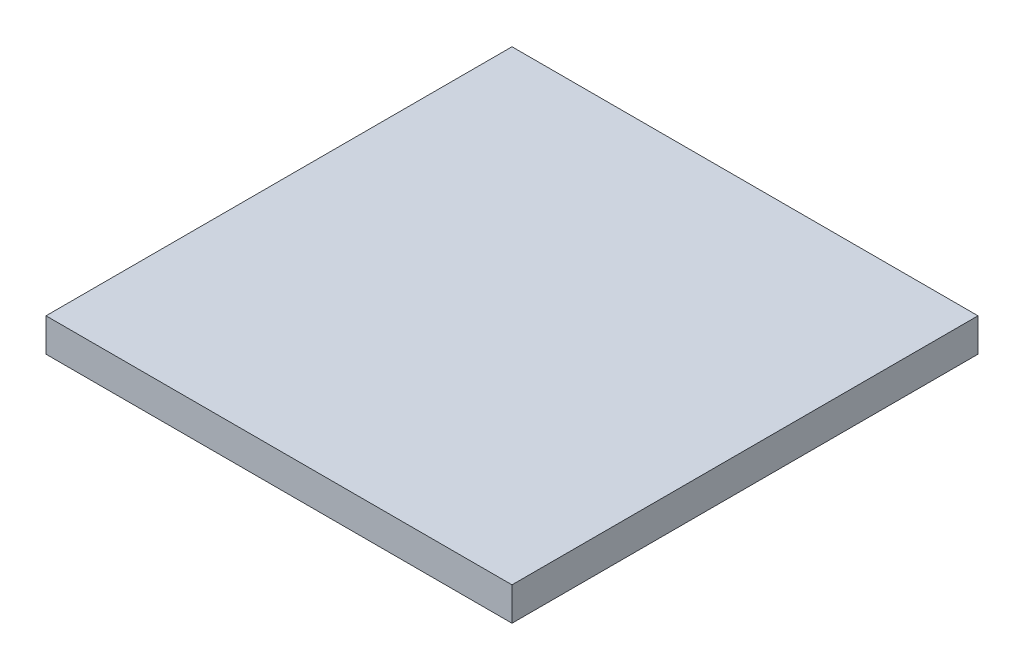
ISO-10303-21;
HEADER;
FILE_DESCRIPTION(('STEP AP214'),'2;1');
FILE_NAME('part.step','',(''),(''),'','','');
FILE_SCHEMA(('AUTOMOTIVE_DESIGN { 1 0 10303 214 1 1 1 1 }'));
ENDSEC;
DATA;
#1=APPLICATION_CONTEXT('core data for automotive mechanical design processes');
#2=APPLICATION_PROTOCOL_DEFINITION('international standard','automotive_design',2000,#1);
#3=PRODUCT_CONTEXT('',#1,'mechanical');
#4=PRODUCT('Part','Part','',(#3));
#5=PRODUCT_RELATED_PRODUCT_CATEGORY('part','',(#4));
#6=PRODUCT_DEFINITION_FORMATION('','',#4);
#7=PRODUCT_DEFINITION_CONTEXT('part definition',#1,'design');
#8=PRODUCT_DEFINITION('design','',#6,#7);
#9=PRODUCT_DEFINITION_SHAPE('','',#8);
#10=(LENGTH_UNIT() NAMED_UNIT(*) SI_UNIT(.MILLI.,.METRE.));
#11=(NAMED_UNIT(*) PLANE_ANGLE_UNIT() SI_UNIT($,.RADIAN.));
#12=(NAMED_UNIT(*) SI_UNIT($,.STERADIAN.) SOLID_ANGLE_UNIT());
#13=UNCERTAINTY_MEASURE_WITH_UNIT(LENGTH_MEASURE(1.E-05),#10,'distance_accuracy_value','');
#14=(GEOMETRIC_REPRESENTATION_CONTEXT(3) GLOBAL_UNCERTAINTY_ASSIGNED_CONTEXT((#13)) GLOBAL_UNIT_ASSIGNED_CONTEXT((#10,
#11,#12)) REPRESENTATION_CONTEXT('',''));
#15=CARTESIAN_POINT('',(0.,0.,0.));
#16=DIRECTION('',(0.,0.,1.));
#17=DIRECTION('',(1.,0.,0.));
#18=AXIS2_PLACEMENT_3D('',#15,#16,#17);
#19=CARTESIAN_POINT('',(0.,0.,0.));
#20=DIRECTION('',(0.,1.,0.));
#21=DIRECTION('',(0.,0.,1.));
#22=AXIS2_PLACEMENT_3D('',#19,#20,#21);
#23=PLANE('',#22);
#24=DIRECTION('',(0.,0.,-1.));
#25=VECTOR('',#24,1.);
#26=CARTESIAN_POINT('',(7.,0.,7.));
#27=LINE('',#26,#25);
#28=CARTESIAN_POINT('',(7.,0.,7.));
#29=VERTEX_POINT('',#28);
#30=CARTESIAN_POINT('',(7.,0.,-7.));
#31=VERTEX_POINT('',#30);
#32=EDGE_CURVE('E57',#29,#31,#27,.T.);
#33=ORIENTED_EDGE('',*,*,#32,.F.);
#34=DIRECTION('',(1.,0.,0.));
#35=VECTOR('',#34,1.);
#36=CARTESIAN_POINT('',(-7.,0.,7.));
#37=LINE('',#36,#35);
#38=CARTESIAN_POINT('',(-7.,0.,7.));
#39=VERTEX_POINT('',#38);
#40=EDGE_CURVE('E20',#39,#29,#37,.T.);
#41=ORIENTED_EDGE('',*,*,#40,.F.);
#42=DIRECTION('',(0.,0.,1.));
#43=VECTOR('',#42,1.);
#44=CARTESIAN_POINT('',(-7.,0.,-7.));
#45=LINE('',#44,#43);
#46=CARTESIAN_POINT('',(-7.,0.,-7.));
#47=VERTEX_POINT('',#46);
#48=EDGE_CURVE('E79',#47,#39,#45,.T.);
#49=ORIENTED_EDGE('',*,*,#48,.F.);
#50=DIRECTION('',(-1.,0.,0.));
#51=VECTOR('',#50,1.);
#52=CARTESIAN_POINT('',(7.,0.,-7.));
#53=LINE('',#52,#51);
#54=EDGE_CURVE('E55',#31,#47,#53,.T.);
#55=ORIENTED_EDGE('',*,*,#54,.F.);
#56=EDGE_LOOP('',(#33,#41,#49,#55));
#57=FACE_BOUND('',#56,.T.);
#58=ADVANCED_FACE('F17',(#57),#23,.F.);
#59=CARTESIAN_POINT('',(-7.,0.,7.));
#60=DIRECTION('',(0.,0.,1.));
#61=DIRECTION('',(1.,0.,0.));
#62=AXIS2_PLACEMENT_3D('',#59,#60,#61);
#63=PLANE('',#62);
#64=DIRECTION('',(1.,0.,0.));
#65=VECTOR('',#64,1.);
#66=CARTESIAN_POINT('',(0.,1.,7.));
#67=LINE('',#66,#65);
#68=CARTESIAN_POINT('',(-7.,1.,7.));
#69=VERTEX_POINT('',#68);
#70=CARTESIAN_POINT('',(7.,1.,7.));
#71=VERTEX_POINT('',#70);
#72=EDGE_CURVE('E83',#69,#71,#67,.T.);
#73=ORIENTED_EDGE('',*,*,#72,.F.);
#74=DIRECTION('',(0.,1.,0.));
#75=VECTOR('',#74,1.);
#76=CARTESIAN_POINT('',(-7.,0.,7.));
#77=LINE('',#76,#75);
#78=EDGE_CURVE('E68',#39,#69,#77,.T.);
#79=ORIENTED_EDGE('',*,*,#78,.F.);
#80=ORIENTED_EDGE('',*,*,#40,.T.);
#81=DIRECTION('',(0.,1.,0.));
#82=VECTOR('',#81,1.);
#83=CARTESIAN_POINT('',(7.,0.,7.));
#84=LINE('',#83,#82);
#85=EDGE_CURVE('E63',#71,#29,#84,.F.);
#86=ORIENTED_EDGE('',*,*,#85,.F.);
#87=EDGE_LOOP('',(#73,#79,#80,#86));
#88=FACE_BOUND('',#87,.T.);
#89=ADVANCED_FACE('F65',(#88),#63,.T.);
#90=CARTESIAN_POINT('',(7.,0.,7.));
#91=DIRECTION('',(1.,0.,0.));
#92=DIRECTION('',(0.,0.,-1.));
#93=AXIS2_PLACEMENT_3D('',#90,#91,#92);
#94=PLANE('',#93);
#95=DIRECTION('',(0.,0.,1.));
#96=VECTOR('',#95,1.);
#97=CARTESIAN_POINT('',(7.,1.,0.));
#98=LINE('',#97,#96);
#99=CARTESIAN_POINT('',(7.,1.,-7.));
#100=VERTEX_POINT('',#99);
#101=EDGE_CURVE('E72',#71,#100,#98,.F.);
#102=ORIENTED_EDGE('',*,*,#101,.F.);
#103=ORIENTED_EDGE('',*,*,#85,.T.);
#104=ORIENTED_EDGE('',*,*,#32,.T.);
#105=DIRECTION('',(0.,1.,0.));
#106=VECTOR('',#105,1.);
#107=CARTESIAN_POINT('',(7.,0.,-7.));
#108=LINE('',#107,#106);
#109=EDGE_CURVE('E75',#100,#31,#108,.F.);
#110=ORIENTED_EDGE('',*,*,#109,.F.);
#111=EDGE_LOOP('',(#102,#103,#104,#110));
#112=FACE_BOUND('',#111,.T.);
#113=ADVANCED_FACE('F70',(#112),#94,.T.);
#114=CARTESIAN_POINT('',(7.,0.,-7.));
#115=DIRECTION('',(0.,0.,-1.));
#116=DIRECTION('',(-1.,0.,0.));
#117=AXIS2_PLACEMENT_3D('',#114,#115,#116);
#118=PLANE('',#117);
#119=DIRECTION('',(1.,0.,0.));
#120=VECTOR('',#119,1.);
#121=CARTESIAN_POINT('',(0.,1.,-7.));
#122=LINE('',#121,#120);
#123=CARTESIAN_POINT('',(-7.,1.,-7.));
#124=VERTEX_POINT('',#123);
#125=EDGE_CURVE('E26',#100,#124,#122,.F.);
#126=ORIENTED_EDGE('',*,*,#125,.F.);
#127=ORIENTED_EDGE('',*,*,#109,.T.);
#128=ORIENTED_EDGE('',*,*,#54,.T.);
#129=DIRECTION('',(0.,1.,0.));
#130=VECTOR('',#129,1.);
#131=CARTESIAN_POINT('',(-7.,0.,-7.));
#132=LINE('',#131,#130);
#133=EDGE_CURVE('E35',#124,#47,#132,.F.);
#134=ORIENTED_EDGE('',*,*,#133,.F.);
#135=EDGE_LOOP('',(#126,#127,#128,#134));
#136=FACE_BOUND('',#135,.T.);
#137=ADVANCED_FACE('F89',(#136),#118,.T.);
#138=CARTESIAN_POINT('',(-7.,0.,-7.));
#139=DIRECTION('',(-1.,0.,0.));
#140=DIRECTION('',(0.,0.,1.));
#141=AXIS2_PLACEMENT_3D('',#138,#139,#140);
#142=PLANE('',#141);
#143=DIRECTION('',(0.,0.,1.));
#144=VECTOR('',#143,1.);
#145=CARTESIAN_POINT('',(-7.,1.,0.));
#146=LINE('',#145,#144);
#147=EDGE_CURVE('E11',#124,#69,#146,.T.);
#148=ORIENTED_EDGE('',*,*,#147,.F.);
#149=ORIENTED_EDGE('',*,*,#133,.T.);
#150=ORIENTED_EDGE('',*,*,#48,.T.);
#151=ORIENTED_EDGE('',*,*,#78,.T.);
#152=EDGE_LOOP('',(#148,#149,#150,#151));
#153=FACE_BOUND('',#152,.T.);
#154=ADVANCED_FACE('F91',(#153),#142,.T.);
#155=CARTESIAN_POINT('',(0.,1.,0.));
#156=DIRECTION('',(0.,1.,0.));
#157=DIRECTION('',(0.,0.,1.));
#158=AXIS2_PLACEMENT_3D('',#155,#156,#157);
#159=PLANE('',#158);
#160=ORIENTED_EDGE('',*,*,#125,.T.);
#161=ORIENTED_EDGE('',*,*,#147,.T.);
#162=ORIENTED_EDGE('',*,*,#72,.T.);
#163=ORIENTED_EDGE('',*,*,#101,.T.);
#164=EDGE_LOOP('',(#160,#161,#162,#163));
#165=FACE_BOUND('',#164,.T.);
#166=ADVANCED_FACE('F88',(#165),#159,.T.);
#167=CLOSED_SHELL('',(#58,#89,#113,#137,#154,#166));
#168=MANIFOLD_SOLID_BREP('B1',#167);
#169=ADVANCED_BREP_SHAPE_REPRESENTATION('',(#18,#168),#14);
#170=SHAPE_DEFINITION_REPRESENTATION(#9,#169);
ENDSEC;
END-ISO-10303-21;
